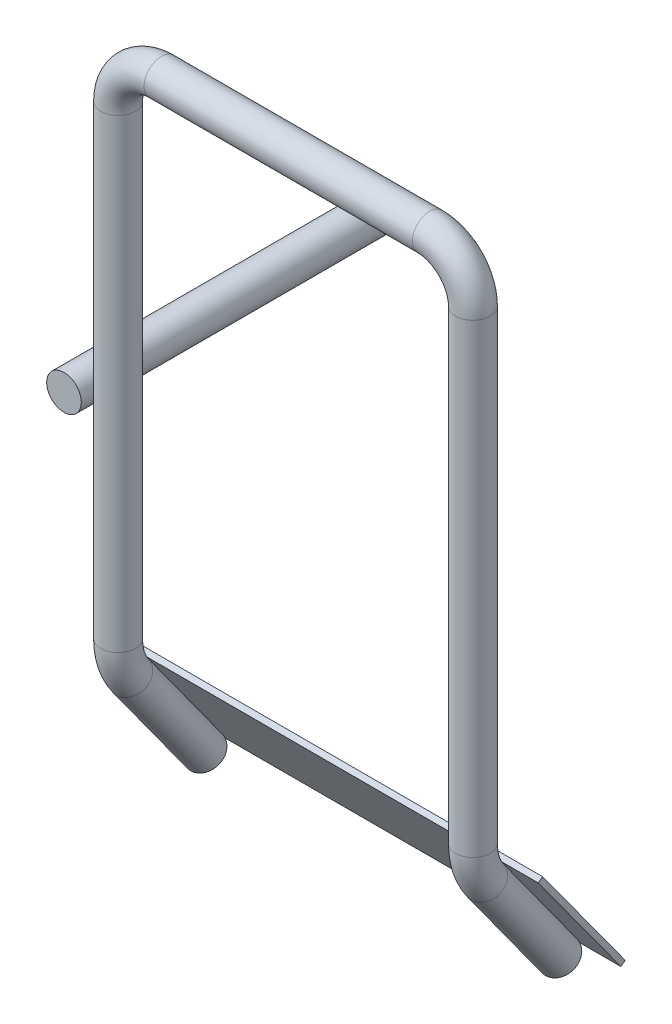
ISO-10303-21;
HEADER;
FILE_DESCRIPTION(('STEP AP214'),'2;1');
FILE_NAME('part.step','',(''),(''),'','','');
FILE_SCHEMA(('AUTOMOTIVE_DESIGN { 1 0 10303 214 1 1 1 1 }'));
ENDSEC;
DATA;
#1=APPLICATION_CONTEXT('core data for automotive mechanical design processes');
#2=APPLICATION_PROTOCOL_DEFINITION('international standard','automotive_design',2000,#1);
#3=PRODUCT_CONTEXT('',#1,'mechanical');
#4=PRODUCT('Part','Part','',(#3));
#5=PRODUCT_RELATED_PRODUCT_CATEGORY('part','',(#4));
#6=PRODUCT_DEFINITION_FORMATION('','',#4);
#7=PRODUCT_DEFINITION_CONTEXT('part definition',#1,'design');
#8=PRODUCT_DEFINITION('design','',#6,#7);
#9=PRODUCT_DEFINITION_SHAPE('','',#8);
#10=(LENGTH_UNIT() NAMED_UNIT(*) SI_UNIT(.MILLI.,.METRE.));
#11=(NAMED_UNIT(*) PLANE_ANGLE_UNIT() SI_UNIT($,.RADIAN.));
#12=(NAMED_UNIT(*) SI_UNIT($,.STERADIAN.) SOLID_ANGLE_UNIT());
#13=UNCERTAINTY_MEASURE_WITH_UNIT(LENGTH_MEASURE(1.E-05),#10,'distance_accuracy_value','');
#14=(GEOMETRIC_REPRESENTATION_CONTEXT(3) GLOBAL_UNCERTAINTY_ASSIGNED_CONTEXT((#13)) GLOBAL_UNIT_ASSIGNED_CONTEXT((#10,
#11,#12)) REPRESENTATION_CONTEXT('',''));
#15=CARTESIAN_POINT('',(0.,0.,0.));
#16=DIRECTION('',(0.,0.,1.));
#17=DIRECTION('',(1.,0.,0.));
#18=AXIS2_PLACEMENT_3D('',#15,#16,#17);
#19=CARTESIAN_POINT('',(-10.,5.21040069591233,19.7823954765698));
#20=DIRECTION('',(0.,-0.587785252292478,0.809016994374944));
#21=DIRECTION('',(0.,-0.809016994374944,-0.587785252292478));
#22=AXIS2_PLACEMENT_3D('',#19,#20,#21);
#23=PLANE('',#22);
#24=DIRECTION('',(1.,0.,0.));
#25=VECTOR('',#24,1.);
#26=CARTESIAN_POINT('',(-10.,-0.0482097675248044,15.9617913366687));
#27=LINE('',#26,#25);
#28=CARTESIAN_POINT('',(-10.,-0.0482097675248044,15.9617913366687));
#29=VERTEX_POINT('',#28);
#30=CARTESIAN_POINT('',(10.,-0.0482097675248044,15.9617913366687));
#31=VERTEX_POINT('',#30);
#32=EDGE_CURVE('E43',#29,#31,#27,.T.);
#33=ORIENTED_EDGE('',*,*,#32,.T.);
#34=DIRECTION('',(0.,-0.809016994374944,-0.587785252292477));
#35=VECTOR('',#34,1.);
#36=CARTESIAN_POINT('',(10.,5.21040069591233,19.7823954765698));
#37=LINE('',#36,#35);
#38=CARTESIAN_POINT('',(10.,5.21040069591233,19.7823954765698));
#39=VERTEX_POINT('',#38);
#40=EDGE_CURVE('E80',#39,#31,#37,.T.);
#41=ORIENTED_EDGE('',*,*,#40,.F.);
#42=DIRECTION('',(1.,0.,0.));
#43=VECTOR('',#42,1.);
#44=CARTESIAN_POINT('',(-10.,5.21040069591233,19.7823954765698));
#45=LINE('',#44,#43);
#46=CARTESIAN_POINT('',(-10.,5.21040069591233,19.7823954765698));
#47=VERTEX_POINT('',#46);
#48=EDGE_CURVE('E12',#47,#39,#45,.T.);
#49=ORIENTED_EDGE('',*,*,#48,.F.);
#50=DIRECTION('',(0.,-0.809016994374944,-0.587785252292477));
#51=VECTOR('',#50,1.);
#52=CARTESIAN_POINT('',(-10.,5.21040069591233,19.7823954765698));
#53=LINE('',#52,#51);
#54=EDGE_CURVE('E82',#47,#29,#53,.T.);
#55=ORIENTED_EDGE('',*,*,#54,.T.);
#56=EDGE_LOOP('',(#33,#41,#49,#55));
#57=FACE_BOUND('',#56,.T.);
#58=ADVANCED_FACE('F40',(#57),#23,.T.);
#59=CARTESIAN_POINT('',(-10.,5.21040069591233,19.7823954765698));
#60=DIRECTION('',(0.,-0.809016994374942,-0.587785252292481));
#61=DIRECTION('',(0.,0.587785252292481,-0.809016994374942));
#62=AXIS2_PLACEMENT_3D('',#59,#60,#61);
#63=PLANE('',#62);
#64=ORIENTED_EDGE('',*,*,#48,.T.);
#65=DIRECTION('',(0.,0.587785252292481,-0.809016994374942));
#66=VECTOR('',#65,1.);
#67=CARTESIAN_POINT('',(10.,5.21040069591233,19.7823954765698));
#68=LINE('',#67,#66);
#69=CARTESIAN_POINT('',(10.,5.35734700898545,19.5801412279761));
#70=VERTEX_POINT('',#69);
#71=EDGE_CURVE('E94',#39,#70,#68,.T.);
#72=ORIENTED_EDGE('',*,*,#71,.T.);
#73=DIRECTION('',(1.,0.,0.));
#74=VECTOR('',#73,1.);
#75=CARTESIAN_POINT('',(-10.,5.35734700898545,19.5801412279761));
#76=LINE('',#75,#74);
#77=CARTESIAN_POINT('',(-10.,5.35734700898545,19.5801412279761));
#78=VERTEX_POINT('',#77);
#79=EDGE_CURVE('E48',#78,#70,#76,.T.);
#80=ORIENTED_EDGE('',*,*,#79,.F.);
#81=DIRECTION('',(0.,0.587785252292481,-0.809016994374942));
#82=VECTOR('',#81,1.);
#83=CARTESIAN_POINT('',(-10.,5.21040069591233,19.7823954765698));
#84=LINE('',#83,#82);
#85=EDGE_CURVE('E61',#47,#78,#84,.T.);
#86=ORIENTED_EDGE('',*,*,#85,.F.);
#87=EDGE_LOOP('',(#64,#72,#80,#86));
#88=FACE_BOUND('',#87,.T.);
#89=ADVANCED_FACE('F113',(#88),#63,.F.);
#90=CARTESIAN_POINT('',(-10.,5.35734700898545,19.5801412279761));
#91=DIRECTION('',(0.,-0.587785252292477,0.809016994374944));
#92=DIRECTION('',(0.,-0.809016994374944,-0.587785252292477));
#93=AXIS2_PLACEMENT_3D('',#90,#91,#92);
#94=PLANE('',#93);
#95=ORIENTED_EDGE('',*,*,#79,.T.);
#96=DIRECTION('',(0.,-0.809016994374944,-0.587785252292478));
#97=VECTOR('',#96,1.);
#98=CARTESIAN_POINT('',(10.,5.35734700898545,19.5801412279761));
#99=LINE('',#98,#97);
#100=CARTESIAN_POINT('',(10.,0.0987365455483143,15.759537088075));
#101=VERTEX_POINT('',#100);
#102=EDGE_CURVE('E98',#70,#101,#99,.T.);
#103=ORIENTED_EDGE('',*,*,#102,.T.);
#104=DIRECTION('',(1.,0.,0.));
#105=VECTOR('',#104,1.);
#106=CARTESIAN_POINT('',(-10.,0.0987365455483143,15.759537088075));
#107=LINE('',#106,#105);
#108=CARTESIAN_POINT('',(-10.,0.0987365455483143,15.759537088075));
#109=VERTEX_POINT('',#108);
#110=EDGE_CURVE('E86',#109,#101,#107,.T.);
#111=ORIENTED_EDGE('',*,*,#110,.F.);
#112=DIRECTION('',(0.,-0.809016994374944,-0.587785252292478));
#113=VECTOR('',#112,1.);
#114=CARTESIAN_POINT('',(-10.,5.35734700898545,19.5801412279761));
#115=LINE('',#114,#113);
#116=EDGE_CURVE('E106',#78,#109,#115,.T.);
#117=ORIENTED_EDGE('',*,*,#116,.F.);
#118=EDGE_LOOP('',(#95,#103,#111,#117));
#119=FACE_BOUND('',#118,.T.);
#120=ADVANCED_FACE('F111',(#119),#94,.F.);
#121=CARTESIAN_POINT('',(-10.,0.0987365455483143,15.759537088075));
#122=DIRECTION('',(0.,0.809016994374944,0.587785252292478));
#123=DIRECTION('',(0.,-0.587785252292478,0.809016994374944));
#124=AXIS2_PLACEMENT_3D('',#121,#122,#123);
#125=PLANE('',#124);
#126=ORIENTED_EDGE('',*,*,#110,.T.);
#127=DIRECTION('',(0.,-0.587785252292478,0.809016994374944));
#128=VECTOR('',#127,1.);
#129=CARTESIAN_POINT('',(10.,0.0987365455483143,15.759537088075));
#130=LINE('',#129,#128);
#131=EDGE_CURVE('E91',#101,#31,#130,.T.);
#132=ORIENTED_EDGE('',*,*,#131,.T.);
#133=ORIENTED_EDGE('',*,*,#32,.F.);
#134=DIRECTION('',(0.,-0.587785252292478,0.809016994374944));
#135=VECTOR('',#134,1.);
#136=CARTESIAN_POINT('',(-10.,0.0987365455483143,15.759537088075));
#137=LINE('',#136,#135);
#138=EDGE_CURVE('E104',#109,#29,#137,.T.);
#139=ORIENTED_EDGE('',*,*,#138,.F.);
#140=EDGE_LOOP('',(#126,#132,#133,#139));
#141=FACE_BOUND('',#140,.T.);
#142=ADVANCED_FACE('F96',(#141),#125,.F.);
#143=CARTESIAN_POINT('',(-10.,-0.0482097675248044,15.9617913366687));
#144=DIRECTION('',(-1.,0.,0.));
#145=DIRECTION('',(0.,0.,1.));
#146=AXIS2_PLACEMENT_3D('',#143,#144,#145);
#147=PLANE('',#146);
#148=ORIENTED_EDGE('',*,*,#54,.F.);
#149=ORIENTED_EDGE('',*,*,#85,.T.);
#150=ORIENTED_EDGE('',*,*,#116,.T.);
#151=ORIENTED_EDGE('',*,*,#138,.T.);
#152=EDGE_LOOP('',(#148,#149,#150,#151));
#153=FACE_BOUND('',#152,.T.);
#154=ADVANCED_FACE('F114',(#153),#147,.T.);
#155=CARTESIAN_POINT('',(10.,-0.0482097675248044,15.9617913366687));
#156=DIRECTION('',(-1.,0.,0.));
#157=DIRECTION('',(0.,0.,1.));
#158=AXIS2_PLACEMENT_3D('',#155,#156,#157);
#159=PLANE('',#158);
#160=ORIENTED_EDGE('',*,*,#40,.T.);
#161=ORIENTED_EDGE('',*,*,#131,.F.);
#162=ORIENTED_EDGE('',*,*,#102,.F.);
#163=ORIENTED_EDGE('',*,*,#71,.F.);
#164=EDGE_LOOP('',(#160,#161,#162,#163));
#165=FACE_BOUND('',#164,.T.);
#166=ADVANCED_FACE('F89',(#165),#159,.F.);
#167=CLOSED_SHELL('',(#58,#89,#120,#142,#154,#166));
#168=MANIFOLD_SOLID_BREP('B2',#167);
#169=CARTESIAN_POINT('',(-8.19999999999999,4.74145549442591,20.4305392862316));
#170=DIRECTION('',(0.,-0.810179762077198,-0.58618150185803));
#171=DIRECTION('',(0.,0.58618150185803,-0.810179762077198));
#172=AXIS2_PLACEMENT_3D('',#169,#170,#171);
#173=CYLINDRICAL_SURFACE('',#172,0.8);
#174=CARTESIAN_POINT('',(-8.19999999999999,4.74145549442591,20.4305392862316));
#175=DIRECTION('',(0.,-0.810179762077198,-0.58618150185803));
#176=DIRECTION('',(0.,-0.58618150185803,0.810179762077198));
#177=AXIS2_PLACEMENT_3D('',#174,#175,#176);
#178=CIRCLE('',#177,0.8);
#179=CARTESIAN_POINT('',(-8.19999999999999,4.27251029293948,21.0786830958934));
#180=VERTEX_POINT('',#179);
#181=EDGE_CURVE('E177',#180,#180,#178,.T.);
#182=ORIENTED_EDGE('',*,*,#181,.T.);
#183=EDGE_LOOP('',(#182));
#184=FACE_BOUND('',#183,.T.);
#185=CARTESIAN_POINT('',(-8.19999999999998,0.,17.));
#186=DIRECTION('',(0.,-0.810179762077198,-0.58618150185803));
#187=DIRECTION('',(0.,-0.58618150185803,0.810179762077198));
#188=AXIS2_PLACEMENT_3D('',#185,#186,#187);
#189=CIRCLE('',#188,0.8);
#190=CARTESIAN_POINT('',(-8.19999999999998,-0.468945201486428,17.6481438096618));
#191=VERTEX_POINT('',#190);
#192=EDGE_CURVE('E173',#191,#191,#189,.T.);
#193=ORIENTED_EDGE('',*,*,#192,.F.);
#194=EDGE_LOOP('',(#193));
#195=FACE_BOUND('',#194,.T.);
#196=ADVANCED_FACE('F163',(#184,#195),#173,.T.);
#197=CARTESIAN_POINT('',(-8.19999999999999,6.5,18.));
#198=DIRECTION('',(1.,0.,0.));
#199=DIRECTION('',(0.,0.,-1.));
#200=AXIS2_PLACEMENT_3D('',#197,#198,#199);
#201=TOROIDAL_SURFACE('',#200,3.,0.8);
#202=CARTESIAN_POINT('',(-8.19999999999999,6.5,21.));
#203=DIRECTION('',(0.,-1.,0.));
#204=DIRECTION('',(0.,0.,1.));
#205=AXIS2_PLACEMENT_3D('',#202,#203,#204);
#206=CIRCLE('',#205,0.8);
#207=CARTESIAN_POINT('',(-8.19999999999999,6.5,21.8));
#208=VERTEX_POINT('',#207);
#209=EDGE_CURVE('E181',#208,#208,#206,.T.);
#210=CARTESIAN_POINT('',(-8.19999999999999,6.5,18.));
#211=DIRECTION('',(1.,0.,0.));
#212=DIRECTION('',(0.,0.,-1.));
#213=AXIS2_PLACEMENT_3D('',#210,#211,#212);
#214=CIRCLE('',#213,3.8);
#215=EDGE_CURVE('',#208,#180,#214,.T.);
#216=ORIENTED_EDGE('',*,*,#209,.T.);
#217=ORIENTED_EDGE('',*,*,#181,.F.);
#218=ORIENTED_EDGE('',*,*,#215,.T.);
#219=ORIENTED_EDGE('',*,*,#215,.F.);
#220=EDGE_LOOP('',(#216,#218,#217,#219));
#221=FACE_BOUND('',#220,.T.);
#222=ADVANCED_FACE('F233',(#221),#201,.T.);
#223=CARTESIAN_POINT('',(-8.19999999999999,28.,21.));
#224=DIRECTION('',(0.,-1.,0.));
#225=DIRECTION('',(0.,0.,-1.));
#226=AXIS2_PLACEMENT_3D('',#223,#224,#225);
#227=CYLINDRICAL_SURFACE('',#226,0.8);
#228=CARTESIAN_POINT('',(-8.9,16.1003811264263,20.6127016653793));
#229=CARTESIAN_POINT('',(-8.90000108615899,16.0788927636309,20.6127019661557));
#230=CARTESIAN_POINT('',(-8.90087357504753,16.0573845828618,20.6142676631666));
#231=CARTESIAN_POINT('',(-8.90428958765181,16.0149429944719,20.6205418459401));
#232=CARTESIAN_POINT('',(-8.90683563531915,15.9940105048266,20.6252550787813));
#233=CARTESIAN_POINT('',(-8.91336066409155,15.9533345673902,20.6378307667931));
#234=CARTESIAN_POINT('',(-8.91734017521601,15.933591562564,20.645694386932));
#235=CARTESIAN_POINT('',(-8.92633031779833,15.8959046596581,20.6645117967201));
#236=CARTESIAN_POINT('',(-8.93134038123048,15.877959778547,20.6754638852781));
#237=CARTESIAN_POINT('',(-8.94176967942311,15.8446736385859,20.7000788899333));
#238=CARTESIAN_POINT('',(-8.94718047292817,15.8292931756019,20.7136923577104));
#239=CARTESIAN_POINT('',(-8.95791011457997,15.8011657799123,20.7434427184309));
#240=CARTESIAN_POINT('',(-8.96322896277334,15.7884188458713,20.7595796100945));
#241=CARTESIAN_POINT('',(-8.97314063561931,15.765979684659,20.7936894475098));
#242=CARTESIAN_POINT('',(-8.97774291663539,15.756245622031,20.8116321867986));
#243=CARTESIAN_POINT('',(-8.98586190831368,15.7396982839509,20.8490450296882));
#244=CARTESIAN_POINT('',(-8.98937846923748,15.7328854113279,20.8685153435024));
#245=CARTESIAN_POINT('',(-8.99504589807573,15.7221251077374,20.9087751317062));
#246=CARTESIAN_POINT('',(-8.99717308294401,15.7182272112143,20.9295811586527));
#247=CARTESIAN_POINT('',(-8.99977492385058,15.7134803592736,20.9716409913248));
#248=CARTESIAN_POINT('',(-9.00024929844531,15.7126319231231,20.992894872692));
#249=CARTESIAN_POINT('',(-8.99949406770238,15.7139976766612,21.0357650386925));
#250=CARTESIAN_POINT('',(-8.99822505658561,15.7162826896024,21.0573784283736));
#251=CARTESIAN_POINT('',(-8.9940301493188,15.7240490306671,21.0998582062611));
#252=CARTESIAN_POINT('',(-8.99110431707498,15.7295302355087,21.1207246232466));
#253=CARTESIAN_POINT('',(-8.98388924317535,15.7436630179296,21.1610470706348));
#254=CARTESIAN_POINT('',(-8.97960344428552,15.7523065982934,21.1805065117082));
#255=CARTESIAN_POINT('',(-8.97010805818289,15.7726869983358,21.2174812511349));
#256=CARTESIAN_POINT('',(-8.96489869939749,15.7844230534896,21.2349970284838));
#257=CARTESIAN_POINT('',(-8.95425517318489,15.8104556251702,21.2671699323192));
#258=CARTESIAN_POINT('',(-8.94882975952958,15.8246815896707,21.2818870755426));
#259=CARTESIAN_POINT('',(-8.93821165760904,15.855546007305,21.3086278064644));
#260=CARTESIAN_POINT('',(-8.93301896036527,15.87218436726,21.3206514981519));
#261=CARTESIAN_POINT('',(-8.92346003400068,15.9072194248663,21.341669377563));
#262=CARTESIAN_POINT('',(-8.91908527370847,15.9255945634306,21.3506957003387));
#263=CARTESIAN_POINT('',(-8.91151526466455,15.9637430117569,21.3658111736646));
#264=CARTESIAN_POINT('',(-8.90832020523307,15.9835165453294,21.3718998528252));
#265=CARTESIAN_POINT('',(-8.90335485080264,16.0243104223423,21.3812094071976));
#266=CARTESIAN_POINT('',(-8.90161351029836,16.0453475463699,21.384372131861));
#267=CARTESIAN_POINT('',(-8.89981873467924,16.0877306414669,21.387630240414));
#268=CARTESIAN_POINT('',(-8.89976556728188,16.1090766609852,21.387725137795));
#269=CARTESIAN_POINT('',(-8.90136960846386,16.1519472367582,21.3848162678466));
#270=CARTESIAN_POINT('',(-8.90306291564304,16.1734660625811,21.3817471018128));
#271=CARTESIAN_POINT('',(-8.90805677311545,16.2156027396789,21.3724022363973));
#272=CARTESIAN_POINT('',(-8.91135719894468,16.2362206605901,21.3661267853257));
#273=CARTESIAN_POINT('',(-8.91921390307491,16.2758179141537,21.350438864626));
#274=CARTESIAN_POINT('',(-8.92376214113363,16.2948067488003,21.3410464007874));
#275=CARTESIAN_POINT('',(-8.93364950589512,16.3307156407304,21.3192196775259));
#276=CARTESIAN_POINT('',(-8.93898844104206,16.3476361972718,21.306786154362));
#277=CARTESIAN_POINT('',(-8.94973761062332,16.3785317945249,21.2794688395336));
#278=CARTESIAN_POINT('',(-8.95514263784615,16.3925704399936,21.2646548713785));
#279=CARTESIAN_POINT('',(-8.96558359466686,16.4179041409347,21.2327300165981));
#280=CARTESIAN_POINT('',(-8.97061952543859,16.4291992051327,21.2156191372783));
#281=CARTESIAN_POINT('',(-8.97977268859855,16.4487906794262,21.1797085800495));
#282=CARTESIAN_POINT('',(-8.98389629394981,16.4571081593089,21.1609219928946));
#283=CARTESIAN_POINT('',(-8.9908765527391,16.4707906434182,21.1220806243154));
#284=CARTESIAN_POINT('',(-8.99373299107833,16.4761551464206,21.1020256282412));
#285=CARTESIAN_POINT('',(-8.99796548856218,16.4840061111138,21.0607507337571));
#286=CARTESIAN_POINT('',(-8.99930791327662,16.4864272730226,21.0395149705675));
#287=CARTESIAN_POINT('',(-9.00027819613736,16.4881831142192,20.996875668544));
#288=CARTESIAN_POINT('',(-8.99990580942131,16.4875173527172,20.9754721061851));
#289=CARTESIAN_POINT('',(-8.99745602843362,16.4830540903597,20.9326839515052));
#290=CARTESIAN_POINT('',(-8.99534685170782,16.4791982054495,20.9113072126106));
#291=CARTESIAN_POINT('',(-8.98958281833435,16.468274139559,20.869608463395));
#292=CARTESIAN_POINT('',(-8.98592812553779,16.4612062990951,20.8492863415229));
#293=CARTESIAN_POINT('',(-8.97748315267653,16.4439797350835,20.8105001818364));
#294=CARTESIAN_POINT('',(-8.97270450382894,16.4338523861251,20.7920197037721));
#295=CARTESIAN_POINT('',(-8.96249509915167,16.4106177202037,20.7572451413539));
#296=CARTESIAN_POINT('',(-8.95706453494397,16.3975112778992,20.7409504174935));
#297=CARTESIAN_POINT('',(-8.94628182883842,16.3689612149154,20.7113728216701));
#298=CARTESIAN_POINT('',(-8.94093117068686,16.3535849884444,20.6980242716331));
#299=CARTESIAN_POINT('',(-8.93072854969459,16.3206495336245,20.6741081715293));
#300=CARTESIAN_POINT('',(-8.92587676976767,16.3030895097631,20.6635416392896));
#301=CARTESIAN_POINT('',(-8.91717504364965,16.2663356598129,20.6453712010079));
#302=CARTESIAN_POINT('',(-8.91332254891342,16.2471461589527,20.637759733308));
#303=CARTESIAN_POINT('',(-8.90697248968612,16.2076480558062,20.6255164345007));
#304=CARTESIAN_POINT('',(-8.90447314540954,16.1873409624213,20.6208806879585));
#305=CARTESIAN_POINT('',(-8.90184584749164,16.155803498761,20.6160527106077));
#306=CARTESIAN_POINT('',(-8.90115551085207,16.1447695100451,20.6147962910925));
#307=CARTESIAN_POINT('',(-8.90023230336161,16.1226191599186,20.6131206857658));
#308=CARTESIAN_POINT('',(-8.89999943783977,16.11150279755,20.6127015097073));
#309=CARTESIAN_POINT('',(-8.9,16.1003811264263,20.6127016653793));
#310=B_SPLINE_CURVE_WITH_KNOTS('',3,(#228,#229,#230,#231,#232,#233,#234,#235,#236,#237,#238,
#239,#240,#241,#242,#243,#244,#245,#246,#247,#248,#249,#250,#251,#252,#253,#254,#255,#256,#257,
#258,#259,#260,#261,#262,#263,#264,#265,#266,#267,#268,#269,#270,#271,#272,#273,#274,#275,#276,
#277,#278,#279,#280,#281,#282,#283,#284,#285,#286,#287,#288,#289,#290,#291,#292,#293,#294,#295,
#296,#297,#298,#299,#300,#301,#302,#303,#304,#305,#306,#307,#308,#309),.UNSPECIFIED.,.T.,.F.,(4,
2,2,2,2,2,2,2,2,2,2,2,2,2,2,2,2,2,2,2,2,2,2,2,2,2,2,2,2,2,2,2,2,2,2,2,2,2,2,2,4),(0.,
0.0644248633971599,0.12894711176311,0.193493241593134,0.258003889395422,0.3214136913512,
0.384823461152996,0.447308538596338,0.509802229899788,0.573335150920169,0.636878889913979,
0.701882783479347,0.766884169912363,0.831722300261663,0.896544416278001,0.959762359494847,
1.02297786156644,1.08549192333294,1.14801601309721,1.21175757382603,1.27550924290495,
1.34060555090935,1.40569681830339,1.47037814226623,1.53504382195919,1.59807612433532,
1.66110822624152,1.72368505190904,1.78627249579421,1.85022452807198,1.91418569250889,
1.97934402882166,2.04449545896781,2.10900023389925,2.17348609470911,2.2363431655218,
2.29922320132094,2.36194125706821,2.42457661871742,2.457920424537,2.49126461877439),.UNSPECIFIED.);
#311=CARTESIAN_POINT('',(-8.9,16.1003811264263,20.6127016653793));
#312=VERTEX_POINT('',#311);
#313=EDGE_CURVE('E39',#312,#312,#310,.T.);
#314=ORIENTED_EDGE('',*,*,#313,.F.);
#315=EDGE_LOOP('',(#314));
#316=FACE_BOUND('',#315,.T.);
#317=CARTESIAN_POINT('',(-8.19999999999999,28.,21.));
#318=DIRECTION('',(0.,-1.,0.));
#319=DIRECTION('',(0.,0.,1.));
#320=AXIS2_PLACEMENT_3D('',#317,#318,#319);
#321=CIRCLE('',#320,0.8);
#322=CARTESIAN_POINT('',(-8.99999999999999,28.,21.));
#323=VERTEX_POINT('',#322);
#324=EDGE_CURVE('E186',#323,#323,#321,.T.);
#325=ORIENTED_EDGE('',*,*,#324,.T.);
#326=EDGE_LOOP('',(#325));
#327=FACE_BOUND('',#326,.T.);
#328=ORIENTED_EDGE('',*,*,#209,.F.);
#329=EDGE_LOOP('',(#328));
#330=FACE_BOUND('',#329,.T.);
#331=ADVANCED_FACE('F238',(#316,#327,#330),#227,.T.);
#332=CARTESIAN_POINT('',(-6.2,28.,21.));
#333=DIRECTION('',(0.,0.,1.));
#334=DIRECTION('',(1.,0.,0.));
#335=AXIS2_PLACEMENT_3D('',#332,#333,#334);
#336=TOROIDAL_SURFACE('',#335,1.99999999999999,0.8);
#337=CARTESIAN_POINT('',(-6.2,30.,21.));
#338=DIRECTION('',(-1.,0.,0.));
#339=DIRECTION('',(0.,0.,1.));
#340=AXIS2_PLACEMENT_3D('',#337,#338,#339);
#341=CIRCLE('',#340,0.8);
#342=CARTESIAN_POINT('',(-6.2,30.8,21.));
#343=VERTEX_POINT('',#342);
#344=EDGE_CURVE('E189',#343,#343,#341,.T.);
#345=CARTESIAN_POINT('',(-6.2,28.,21.));
#346=DIRECTION('',(0.,0.,1.));
#347=DIRECTION('',(1.,0.,0.));
#348=AXIS2_PLACEMENT_3D('',#345,#346,#347);
#349=CIRCLE('',#348,2.8);
#350=EDGE_CURVE('',#343,#323,#349,.T.);
#351=ORIENTED_EDGE('',*,*,#344,.T.);
#352=ORIENTED_EDGE('',*,*,#324,.F.);
#353=ORIENTED_EDGE('',*,*,#350,.T.);
#354=ORIENTED_EDGE('',*,*,#350,.F.);
#355=EDGE_LOOP('',(#351,#353,#352,#354));
#356=FACE_BOUND('',#355,.T.);
#357=ADVANCED_FACE('F246',(#356),#336,.T.);
#358=CARTESIAN_POINT('',(6.2,30.,21.));
#359=DIRECTION('',(-1.,0.,0.));
#360=DIRECTION('',(0.,0.,1.));
#361=AXIS2_PLACEMENT_3D('',#358,#359,#360);
#362=CYLINDRICAL_SURFACE('',#361,0.8);
#363=CARTESIAN_POINT('',(6.2,30.,21.));
#364=DIRECTION('',(-1.,0.,0.));
#365=DIRECTION('',(0.,0.,1.));
#366=AXIS2_PLACEMENT_3D('',#363,#364,#365);
#367=CIRCLE('',#366,0.8);
#368=CARTESIAN_POINT('',(6.2,30.8,21.));
#369=VERTEX_POINT('',#368);
#370=EDGE_CURVE('E192',#369,#369,#367,.T.);
#371=ORIENTED_EDGE('',*,*,#370,.T.);
#372=EDGE_LOOP('',(#371));
#373=FACE_BOUND('',#372,.T.);
#374=ORIENTED_EDGE('',*,*,#344,.F.);
#375=EDGE_LOOP('',(#374));
#376=FACE_BOUND('',#375,.T.);
#377=ADVANCED_FACE('F252',(#373,#376),#362,.T.);
#378=CARTESIAN_POINT('',(6.2,28.,21.));
#379=DIRECTION('',(0.,0.,1.));
#380=DIRECTION('',(1.,0.,0.));
#381=AXIS2_PLACEMENT_3D('',#378,#379,#380);
#382=TOROIDAL_SURFACE('',#381,2.,0.8);
#383=CARTESIAN_POINT('',(8.2,28.,21.));
#384=DIRECTION('',(0.,1.,0.));
#385=DIRECTION('',(0.,0.,1.));
#386=AXIS2_PLACEMENT_3D('',#383,#384,#385);
#387=CIRCLE('',#386,0.8);
#388=CARTESIAN_POINT('',(9.,28.,21.));
#389=VERTEX_POINT('',#388);
#390=EDGE_CURVE('E195',#389,#389,#387,.T.);
#391=CARTESIAN_POINT('',(6.2,28.,21.));
#392=DIRECTION('',(0.,0.,1.));
#393=DIRECTION('',(1.,0.,0.));
#394=AXIS2_PLACEMENT_3D('',#391,#392,#393);
#395=CIRCLE('',#394,2.8);
#396=EDGE_CURVE('',#389,#369,#395,.T.);
#397=ORIENTED_EDGE('',*,*,#390,.T.);
#398=ORIENTED_EDGE('',*,*,#370,.F.);
#399=ORIENTED_EDGE('',*,*,#396,.T.);
#400=ORIENTED_EDGE('',*,*,#396,.F.);
#401=EDGE_LOOP('',(#397,#399,#398,#400));
#402=FACE_BOUND('',#401,.T.);
#403=ADVANCED_FACE('F256',(#402),#382,.T.);
#404=CARTESIAN_POINT('',(8.2,6.5,21.));
#405=DIRECTION('',(0.,1.,0.));
#406=DIRECTION('',(0.,0.,1.));
#407=AXIS2_PLACEMENT_3D('',#404,#405,#406);
#408=CYLINDRICAL_SURFACE('',#407,0.8);
#409=CARTESIAN_POINT('',(8.2,6.5,21.));
#410=DIRECTION('',(0.,1.,0.));
#411=DIRECTION('',(0.,0.,1.));
#412=AXIS2_PLACEMENT_3D('',#409,#410,#411);
#413=CIRCLE('',#412,0.8);
#414=CARTESIAN_POINT('',(8.2,6.5,21.8));
#415=VERTEX_POINT('',#414);
#416=EDGE_CURVE('E198',#415,#415,#413,.T.);
#417=ORIENTED_EDGE('',*,*,#416,.T.);
#418=EDGE_LOOP('',(#417));
#419=FACE_BOUND('',#418,.T.);
#420=ORIENTED_EDGE('',*,*,#390,.F.);
#421=EDGE_LOOP('',(#420));
#422=FACE_BOUND('',#421,.T.);
#423=ADVANCED_FACE('F260',(#419,#422),#408,.T.);
#424=CARTESIAN_POINT('',(8.2,6.5,18.));
#425=DIRECTION('',(-1.,0.,0.));
#426=DIRECTION('',(0.,0.,1.));
#427=AXIS2_PLACEMENT_3D('',#424,#425,#426);
#428=TOROIDAL_SURFACE('',#427,3.,0.8);
#429=CARTESIAN_POINT('',(8.2,4.74145549442591,20.4305392862316));
#430=DIRECTION('',(0.,0.810179762077197,0.586181501858031));
#431=DIRECTION('',(0.,-0.586181501858031,0.810179762077197));
#432=AXIS2_PLACEMENT_3D('',#429,#430,#431);
#433=CIRCLE('',#432,0.8);
#434=CARTESIAN_POINT('',(8.2,4.27251029293948,21.0786830958934));
#435=VERTEX_POINT('',#434);
#436=EDGE_CURVE('E201',#435,#435,#433,.T.);
#437=CARTESIAN_POINT('',(8.2,6.5,18.));
#438=DIRECTION('',(-1.,0.,0.));
#439=DIRECTION('',(0.,0.,1.));
#440=AXIS2_PLACEMENT_3D('',#437,#438,#439);
#441=CIRCLE('',#440,3.8);
#442=EDGE_CURVE('',#435,#415,#441,.T.);
#443=ORIENTED_EDGE('',*,*,#436,.T.);
#444=ORIENTED_EDGE('',*,*,#416,.F.);
#445=ORIENTED_EDGE('',*,*,#442,.T.);
#446=ORIENTED_EDGE('',*,*,#442,.F.);
#447=EDGE_LOOP('',(#443,#445,#444,#446));
#448=FACE_BOUND('',#447,.T.);
#449=ADVANCED_FACE('F264',(#448),#428,.T.);
#450=CARTESIAN_POINT('',(8.2,4.74145549442591,20.4305392862316));
#451=DIRECTION('',(0.,-0.810179762077197,-0.586181501858031));
#452=DIRECTION('',(0.,0.586181501858031,-0.810179762077197));
#453=AXIS2_PLACEMENT_3D('',#450,#451,#452);
#454=CYLINDRICAL_SURFACE('',#453,0.8);
#455=ORIENTED_EDGE('',*,*,#436,.F.);
#456=EDGE_LOOP('',(#455));
#457=FACE_BOUND('',#456,.T.);
#458=CARTESIAN_POINT('',(8.20000000000001,0.,17.));
#459=DIRECTION('',(0.,0.810179762077197,0.586181501858031));
#460=DIRECTION('',(0.,-0.586181501858031,0.810179762077197));
#461=AXIS2_PLACEMENT_3D('',#458,#459,#460);
#462=CIRCLE('',#461,0.8);
#463=CARTESIAN_POINT('',(8.20000000000001,-0.468945201486425,17.6481438096618));
#464=VERTEX_POINT('',#463);
#465=EDGE_CURVE('E202',#464,#464,#462,.T.);
#466=ORIENTED_EDGE('',*,*,#465,.T.);
#467=EDGE_LOOP('',(#466));
#468=FACE_BOUND('',#467,.T.);
#469=ADVANCED_FACE('F268',(#457,#468),#454,.T.);
#470=CARTESIAN_POINT('',(-8.19999999999998,0.,17.));
#471=DIRECTION('',(0.,-0.810179762077198,-0.58618150185803));
#472=DIRECTION('',(0.,-0.58618150185803,0.810179762077198));
#473=AXIS2_PLACEMENT_3D('',#470,#471,#472);
#474=PLANE('',#473);
#475=ORIENTED_EDGE('',*,*,#192,.T.);
#476=EDGE_LOOP('',(#475));
#477=FACE_BOUND('',#476,.T.);
#478=ADVANCED_FACE('F226',(#477),#474,.T.);
#479=CARTESIAN_POINT('',(8.20000000000001,0.,17.));
#480=DIRECTION('',(0.,0.810179762077197,0.586181501858031));
#481=DIRECTION('',(0.,-0.586181501858031,0.810179762077197));
#482=AXIS2_PLACEMENT_3D('',#479,#480,#481);
#483=PLANE('',#482);
#484=ORIENTED_EDGE('',*,*,#465,.F.);
#485=EDGE_LOOP('',(#484));
#486=FACE_BOUND('',#485,.T.);
#487=ADVANCED_FACE('F219',(#486),#483,.F.);
#488=CARTESIAN_POINT('',(-9.7,16.1003811264263,7.));
#489=DIRECTION('',(0.,0.,1.));
#490=DIRECTION('',(1.,0.,0.));
#491=AXIS2_PLACEMENT_3D('',#488,#489,#490);
#492=CYLINDRICAL_SURFACE('',#491,0.8);
#493=ORIENTED_EDGE('',*,*,#313,.T.);
#494=EDGE_LOOP('',(#493));
#495=FACE_BOUND('',#494,.T.);
#496=CARTESIAN_POINT('',(-9.7,16.1003811264263,7.));
#497=DIRECTION('',(0.,0.,1.));
#498=DIRECTION('',(1.,0.,0.));
#499=AXIS2_PLACEMENT_3D('',#496,#497,#498);
#500=CIRCLE('',#499,0.8);
#501=CARTESIAN_POINT('',(-8.9,16.1003811264263,7.));
#502=VERTEX_POINT('',#501);
#503=EDGE_CURVE('E205',#502,#502,#500,.T.);
#504=ORIENTED_EDGE('',*,*,#503,.T.);
#505=EDGE_LOOP('',(#504));
#506=FACE_BOUND('',#505,.T.);
#507=CARTESIAN_POINT('',(-9.7,16.1003811264263,22.));
#508=DIRECTION('',(0.,0.,1.));
#509=DIRECTION('',(1.,0.,0.));
#510=AXIS2_PLACEMENT_3D('',#507,#508,#509);
#511=CIRCLE('',#510,0.8);
#512=CARTESIAN_POINT('',(-8.9,16.1003811264263,22.));
#513=VERTEX_POINT('',#512);
#514=EDGE_CURVE('E210',#513,#513,#511,.T.);
#515=ORIENTED_EDGE('',*,*,#514,.F.);
#516=EDGE_LOOP('',(#515));
#517=FACE_BOUND('',#516,.T.);
#518=ADVANCED_FACE('F216',(#495,#506,#517),#492,.T.);
#519=CARTESIAN_POINT('',(-9.7,16.1003811264263,7.));
#520=DIRECTION('',(0.,0.,1.));
#521=DIRECTION('',(1.,0.,0.));
#522=AXIS2_PLACEMENT_3D('',#519,#520,#521);
#523=PLANE('',#522);
#524=ORIENTED_EDGE('',*,*,#503,.F.);
#525=EDGE_LOOP('',(#524));
#526=FACE_BOUND('',#525,.T.);
#527=ADVANCED_FACE('F218',(#526),#523,.F.);
#528=CARTESIAN_POINT('',(-9.7,16.1003811264263,22.));
#529=DIRECTION('',(0.,0.,1.));
#530=DIRECTION('',(1.,0.,0.));
#531=AXIS2_PLACEMENT_3D('',#528,#529,#530);
#532=PLANE('',#531);
#533=ORIENTED_EDGE('',*,*,#514,.T.);
#534=EDGE_LOOP('',(#533));
#535=FACE_BOUND('',#534,.T.);
#536=ADVANCED_FACE('F214',(#535),#532,.T.);
#537=CLOSED_SHELL('',(#196,#222,#331,#357,#377,#403,#423,#449,#469,#478,#487,#518,#527,#536));
#538=MANIFOLD_SOLID_BREP('B6',#537);
#539=ADVANCED_BREP_SHAPE_REPRESENTATION('',(#18,#168,#538),#14);
#540=SHAPE_DEFINITION_REPRESENTATION(#9,#539);
ENDSEC;
END-ISO-10303-21;
